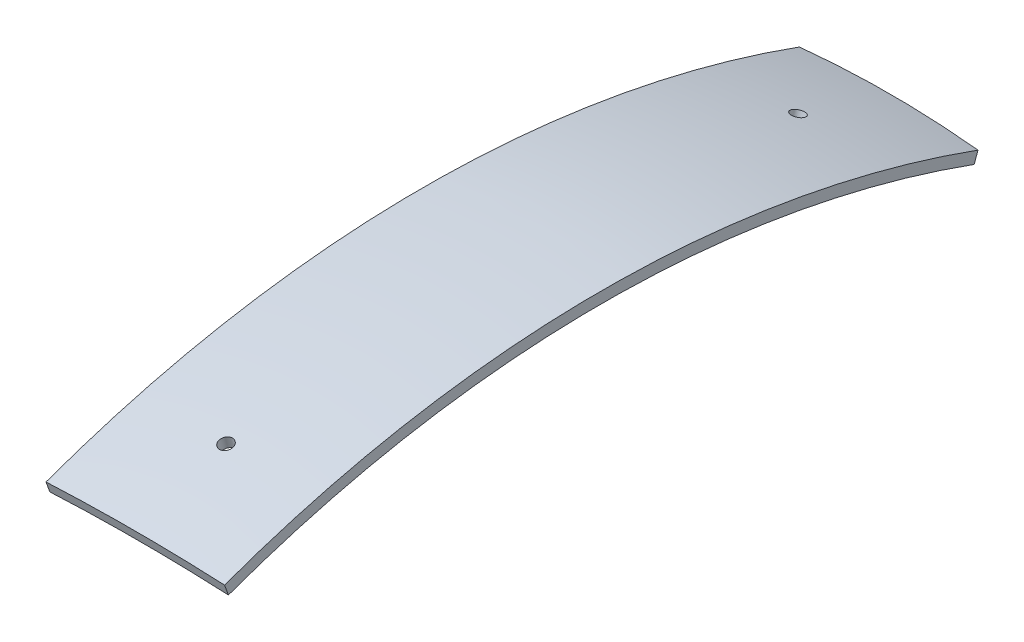
ISO-10303-21;
HEADER;
FILE_DESCRIPTION(('STEP AP214'),'2;1');
FILE_NAME('part.step','',(''),(''),'','','');
FILE_SCHEMA(('AUTOMOTIVE_DESIGN { 1 0 10303 214 1 1 1 1 }'));
ENDSEC;
DATA;
#1=APPLICATION_CONTEXT('core data for automotive mechanical design processes');
#2=APPLICATION_PROTOCOL_DEFINITION('international standard','automotive_design',2000,#1);
#3=PRODUCT_CONTEXT('',#1,'mechanical');
#4=PRODUCT('Part','Part','',(#3));
#5=PRODUCT_RELATED_PRODUCT_CATEGORY('part','',(#4));
#6=PRODUCT_DEFINITION_FORMATION('','',#4);
#7=PRODUCT_DEFINITION_CONTEXT('part definition',#1,'design');
#8=PRODUCT_DEFINITION('design','',#6,#7);
#9=PRODUCT_DEFINITION_SHAPE('','',#8);
#10=(LENGTH_UNIT() NAMED_UNIT(*) SI_UNIT(.MILLI.,.METRE.));
#11=(NAMED_UNIT(*) PLANE_ANGLE_UNIT() SI_UNIT($,.RADIAN.));
#12=(NAMED_UNIT(*) SI_UNIT($,.STERADIAN.) SOLID_ANGLE_UNIT());
#13=UNCERTAINTY_MEASURE_WITH_UNIT(LENGTH_MEASURE(1.E-05),#10,'distance_accuracy_value','');
#14=(GEOMETRIC_REPRESENTATION_CONTEXT(3) GLOBAL_UNCERTAINTY_ASSIGNED_CONTEXT((#13)) GLOBAL_UNIT_ASSIGNED_CONTEXT((#10,
#11,#12)) REPRESENTATION_CONTEXT('',''));
#15=CARTESIAN_POINT('',(0.,0.,0.));
#16=DIRECTION('',(0.,0.,1.));
#17=DIRECTION('',(1.,0.,0.));
#18=AXIS2_PLACEMENT_3D('',#15,#16,#17);
#19=CARTESIAN_POINT('',(0.,0.,0.));
#20=DIRECTION('',(-1.,0.,0.));
#21=DIRECTION('',(0.,0.939692620785908,0.342020143325669));
#22=AXIS2_PLACEMENT_3D('',#19,#20,#21);
#23=SPHERICAL_SURFACE('',#22,245.);
#24=CARTESIAN_POINT('',(0.,236.647392025564,-63.4094775841814));
#25=DIRECTION('',(0.,-0.965925826289068,0.258819045102521));
#26=DIRECTION('',(0.,-0.258819045102521,-0.965925826289068));
#27=AXIS2_PLACEMENT_3D('',#24,#25,#26);
#28=CIRCLE('',#27,1.5);
#29=CARTESIAN_POINT('',(0.,236.259163457911,-64.8583663236151));
#30=VERTEX_POINT('',#29);
#31=EDGE_CURVE('E110',#30,#30,#28,.T.);
#32=ORIENTED_EDGE('',*,*,#31,.F.);
#33=EDGE_LOOP('',(#32));
#34=FACE_BOUND('',#33,.T.);
#35=CARTESIAN_POINT('',(0.,236.647392025564,63.4094775841814));
#36=DIRECTION('',(0.,-0.965925826289068,-0.258819045102521));
#37=DIRECTION('',(0.,0.258819045102521,-0.965925826289068));
#38=AXIS2_PLACEMENT_3D('',#35,#36,#37);
#39=CIRCLE('',#38,1.5);
#40=CARTESIAN_POINT('',(0.,237.035620593218,61.9605888447478));
#41=VERTEX_POINT('',#40);
#42=EDGE_CURVE('E89',#41,#41,#39,.T.);
#43=ORIENTED_EDGE('',*,*,#42,.F.);
#44=EDGE_LOOP('',(#43));
#45=FACE_BOUND('',#44,.T.);
#46=CARTESIAN_POINT('',(20.,0.,0.));
#47=DIRECTION('',(-1.,0.,0.));
#48=DIRECTION('',(0.,0.,1.));
#49=AXIS2_PLACEMENT_3D('',#46,#47,#48);
#50=CIRCLE('',#49,244.182308941496);
#51=CARTESIAN_POINT('',(20.,229.456313838788,83.5152683017632));
#52=VERTEX_POINT('',#51);
#53=CARTESIAN_POINT('',(20.,229.456313838788,-83.5152683017632));
#54=VERTEX_POINT('',#53);
#55=EDGE_CURVE('E11',#52,#54,#50,.T.);
#56=ORIENTED_EDGE('',*,*,#55,.F.);
#57=CARTESIAN_POINT('',(0.,0.,0.));
#58=DIRECTION('',(0.,-0.342020143325669,0.939692620785908));
#59=DIRECTION('',(1.,0.,0.));
#60=AXIS2_PLACEMENT_3D('',#57,#58,#59);
#61=CIRCLE('',#60,245.);
#62=CARTESIAN_POINT('',(-20.,229.456313838788,83.5152683017632));
#63=VERTEX_POINT('',#62);
#64=EDGE_CURVE('E99',#52,#63,#61,.T.);
#65=ORIENTED_EDGE('',*,*,#64,.T.);
#66=CARTESIAN_POINT('',(-20.,0.,0.));
#67=DIRECTION('',(-1.,0.,0.));
#68=DIRECTION('',(0.,0.,1.));
#69=AXIS2_PLACEMENT_3D('',#66,#67,#68);
#70=CIRCLE('',#69,244.182308941496);
#71=CARTESIAN_POINT('',(-20.,229.456313838788,-83.5152683017632));
#72=VERTEX_POINT('',#71);
#73=EDGE_CURVE('E50',#63,#72,#70,.T.);
#74=ORIENTED_EDGE('',*,*,#73,.T.);
#75=CARTESIAN_POINT('',(0.,0.,0.));
#76=DIRECTION('',(0.,0.342020143325669,0.939692620785908));
#77=DIRECTION('',(1.,0.,0.));
#78=AXIS2_PLACEMENT_3D('',#75,#76,#77);
#79=CIRCLE('',#78,245.);
#80=EDGE_CURVE('E86',#54,#72,#79,.T.);
#81=ORIENTED_EDGE('',*,*,#80,.F.);
#82=EDGE_LOOP('',(#56,#65,#74,#81));
#83=FACE_BOUND('',#82,.T.);
#84=ADVANCED_FACE('F33',(#34,#45,#83),#23,.F.);
#85=CARTESIAN_POINT('',(20.,0.,0.));
#86=DIRECTION('',(-1.,0.,0.));
#87=DIRECTION('',(0.,0.,1.));
#88=AXIS2_PLACEMENT_3D('',#85,#86,#87);
#89=PLANE('',#88);
#90=CARTESIAN_POINT('',(20.,0.,0.));
#91=DIRECTION('',(-1.,0.,0.));
#92=DIRECTION('',(0.,0.,1.));
#93=AXIS2_PLACEMENT_3D('',#90,#91,#92);
#94=CIRCLE('',#93,246.690595686175);
#95=CARTESIAN_POINT('',(20.,231.813332383579,84.3731528936804));
#96=VERTEX_POINT('',#95);
#97=CARTESIAN_POINT('',(20.,231.813332383579,-84.3731528936804));
#98=VERTEX_POINT('',#97);
#99=EDGE_CURVE('E42',#96,#98,#94,.T.);
#100=ORIENTED_EDGE('',*,*,#99,.F.);
#101=DIRECTION('',(0.,0.939692620785908,0.342020143325669));
#102=VECTOR('',#101,1.);
#103=CARTESIAN_POINT('',(20.,0.,0.));
#104=LINE('',#103,#102);
#105=EDGE_CURVE('E82',#52,#96,#104,.T.);
#106=ORIENTED_EDGE('',*,*,#105,.F.);
#107=ORIENTED_EDGE('',*,*,#55,.T.);
#108=DIRECTION('',(0.,0.939692620785908,-0.342020143325669));
#109=VECTOR('',#108,1.);
#110=CARTESIAN_POINT('',(20.,0.,0.));
#111=LINE('',#110,#109);
#112=EDGE_CURVE('E79',#54,#98,#111,.T.);
#113=ORIENTED_EDGE('',*,*,#112,.T.);
#114=EDGE_LOOP('',(#100,#106,#107,#113));
#115=FACE_BOUND('',#114,.T.);
#116=ADVANCED_FACE('F35',(#115),#89,.F.);
#117=CARTESIAN_POINT('',(0.,0.,0.));
#118=DIRECTION('',(-1.,0.,0.));
#119=DIRECTION('',(0.,0.939692620785908,0.342020143325669));
#120=AXIS2_PLACEMENT_3D('',#117,#118,#119);
#121=SPHERICAL_SURFACE('',#120,247.5);
#122=CARTESIAN_POINT('',(0.,239.062251394288,-64.0565372018658));
#123=DIRECTION('',(0.,-0.965925826289068,0.258819045102521));
#124=DIRECTION('',(0.,-0.258819045102521,-0.965925826289068));
#125=AXIS2_PLACEMENT_3D('',#122,#123,#124);
#126=CIRCLE('',#125,1.5);
#127=CARTESIAN_POINT('',(0.,238.674022826635,-65.5054259412994));
#128=VERTEX_POINT('',#127);
#129=EDGE_CURVE('E37',#128,#128,#126,.T.);
#130=ORIENTED_EDGE('',*,*,#129,.T.);
#131=EDGE_LOOP('',(#130));
#132=FACE_BOUND('',#131,.T.);
#133=CARTESIAN_POINT('',(0.,239.062251394288,64.0565372018658));
#134=DIRECTION('',(0.,-0.965925826289068,-0.258819045102521));
#135=DIRECTION('',(0.,0.258819045102521,-0.965925826289068));
#136=AXIS2_PLACEMENT_3D('',#133,#134,#135);
#137=CIRCLE('',#136,1.5);
#138=CARTESIAN_POINT('',(0.,239.450479961942,62.6076484624322));
#139=VERTEX_POINT('',#138);
#140=EDGE_CURVE('E108',#139,#139,#137,.T.);
#141=ORIENTED_EDGE('',*,*,#140,.T.);
#142=EDGE_LOOP('',(#141));
#143=FACE_BOUND('',#142,.T.);
#144=CARTESIAN_POINT('',(-20.,0.,0.));
#145=DIRECTION('',(-1.,0.,0.));
#146=DIRECTION('',(0.,0.,1.));
#147=AXIS2_PLACEMENT_3D('',#144,#145,#146);
#148=CIRCLE('',#147,246.690595686175);
#149=CARTESIAN_POINT('',(-20.,231.813332383579,84.3731528936804));
#150=VERTEX_POINT('',#149);
#151=CARTESIAN_POINT('',(-20.,231.813332383579,-84.3731528936804));
#152=VERTEX_POINT('',#151);
#153=EDGE_CURVE('E58',#150,#152,#148,.T.);
#154=ORIENTED_EDGE('',*,*,#153,.F.);
#155=CARTESIAN_POINT('',(0.,0.,0.));
#156=DIRECTION('',(0.,-0.342020143325669,0.939692620785908));
#157=DIRECTION('',(1.,0.,0.));
#158=AXIS2_PLACEMENT_3D('',#155,#156,#157);
#159=CIRCLE('',#158,247.5);
#160=EDGE_CURVE('E102',#96,#150,#159,.T.);
#161=ORIENTED_EDGE('',*,*,#160,.F.);
#162=ORIENTED_EDGE('',*,*,#99,.T.);
#163=CARTESIAN_POINT('',(0.,0.,0.));
#164=DIRECTION('',(0.,0.342020143325669,0.939692620785908));
#165=DIRECTION('',(1.,0.,0.));
#166=AXIS2_PLACEMENT_3D('',#163,#164,#165);
#167=CIRCLE('',#166,247.5);
#168=EDGE_CURVE('E92',#98,#152,#167,.T.);
#169=ORIENTED_EDGE('',*,*,#168,.T.);
#170=EDGE_LOOP('',(#154,#161,#162,#169));
#171=FACE_BOUND('',#170,.T.);
#172=ADVANCED_FACE('F121',(#132,#143,#171),#121,.T.);
#173=CARTESIAN_POINT('',(-20.,0.,0.));
#174=DIRECTION('',(-1.,0.,0.));
#175=DIRECTION('',(0.,0.,1.));
#176=AXIS2_PLACEMENT_3D('',#173,#174,#175);
#177=PLANE('',#176);
#178=DIRECTION('',(0.,0.939692620785908,0.342020143325669));
#179=VECTOR('',#178,1.);
#180=CARTESIAN_POINT('',(-20.,0.,0.));
#181=LINE('',#180,#179);
#182=EDGE_CURVE('E104',#63,#150,#181,.T.);
#183=ORIENTED_EDGE('',*,*,#182,.T.);
#184=ORIENTED_EDGE('',*,*,#153,.T.);
#185=DIRECTION('',(0.,0.939692620785908,-0.342020143325669));
#186=VECTOR('',#185,1.);
#187=CARTESIAN_POINT('',(-20.,0.,0.));
#188=LINE('',#187,#186);
#189=EDGE_CURVE('E94',#72,#152,#188,.T.);
#190=ORIENTED_EDGE('',*,*,#189,.F.);
#191=ORIENTED_EDGE('',*,*,#73,.F.);
#192=EDGE_LOOP('',(#183,#184,#190,#191));
#193=FACE_BOUND('',#192,.T.);
#194=ADVANCED_FACE('F143',(#193),#177,.T.);
#195=CARTESIAN_POINT('',(0.,0.,0.));
#196=DIRECTION('',(0.,-0.342020143325669,0.939692620785908));
#197=DIRECTION('',(1.,0.,0.));
#198=AXIS2_PLACEMENT_3D('',#195,#196,#197);
#199=PLANE('',#198);
#200=ORIENTED_EDGE('',*,*,#64,.F.);
#201=ORIENTED_EDGE('',*,*,#105,.T.);
#202=ORIENTED_EDGE('',*,*,#160,.T.);
#203=ORIENTED_EDGE('',*,*,#182,.F.);
#204=EDGE_LOOP('',(#200,#201,#202,#203));
#205=FACE_BOUND('',#204,.T.);
#206=ADVANCED_FACE('F141',(#205),#199,.T.);
#207=CARTESIAN_POINT('',(0.,0.,0.));
#208=DIRECTION('',(0.,0.342020143325669,0.939692620785908));
#209=DIRECTION('',(1.,0.,0.));
#210=AXIS2_PLACEMENT_3D('',#207,#208,#209);
#211=PLANE('',#210);
#212=ORIENTED_EDGE('',*,*,#80,.T.);
#213=ORIENTED_EDGE('',*,*,#189,.T.);
#214=ORIENTED_EDGE('',*,*,#168,.F.);
#215=ORIENTED_EDGE('',*,*,#112,.F.);
#216=EDGE_LOOP('',(#212,#213,#214,#215));
#217=FACE_BOUND('',#216,.T.);
#218=ADVANCED_FACE('F91',(#217),#211,.F.);
#219=CARTESIAN_POINT('',(0.,0.,0.));
#220=DIRECTION('',(0.,-0.965925826289068,-0.258819045102521));
#221=DIRECTION('',(0.,0.258819045102521,-0.965925826289068));
#222=AXIS2_PLACEMENT_3D('',#219,#220,#221);
#223=CYLINDRICAL_SURFACE('',#222,1.5);
#224=ORIENTED_EDGE('',*,*,#42,.T.);
#225=EDGE_LOOP('',(#224));
#226=FACE_BOUND('',#225,.T.);
#227=ORIENTED_EDGE('',*,*,#140,.F.);
#228=EDGE_LOOP('',(#227));
#229=FACE_BOUND('',#228,.T.);
#230=ADVANCED_FACE('F125',(#226,#229),#223,.F.);
#231=CARTESIAN_POINT('',(0.,0.,0.));
#232=DIRECTION('',(0.,-0.965925826289068,0.258819045102521));
#233=DIRECTION('',(0.,0.258819045102521,0.965925826289068));
#234=AXIS2_PLACEMENT_3D('',#231,#232,#233);
#235=CYLINDRICAL_SURFACE('',#234,1.5);
#236=ORIENTED_EDGE('',*,*,#31,.T.);
#237=EDGE_LOOP('',(#236));
#238=FACE_BOUND('',#237,.T.);
#239=ORIENTED_EDGE('',*,*,#129,.F.);
#240=EDGE_LOOP('',(#239));
#241=FACE_BOUND('',#240,.T.);
#242=ADVANCED_FACE('F123',(#238,#241),#235,.F.);
#243=CLOSED_SHELL('',(#84,#116,#172,#194,#206,#218,#230,#242));
#244=MANIFOLD_SOLID_BREP('B2',#243);
#245=ADVANCED_BREP_SHAPE_REPRESENTATION('',(#18,#244),#14);
#246=SHAPE_DEFINITION_REPRESENTATION(#9,#245);
ENDSEC;
END-ISO-10303-21;
